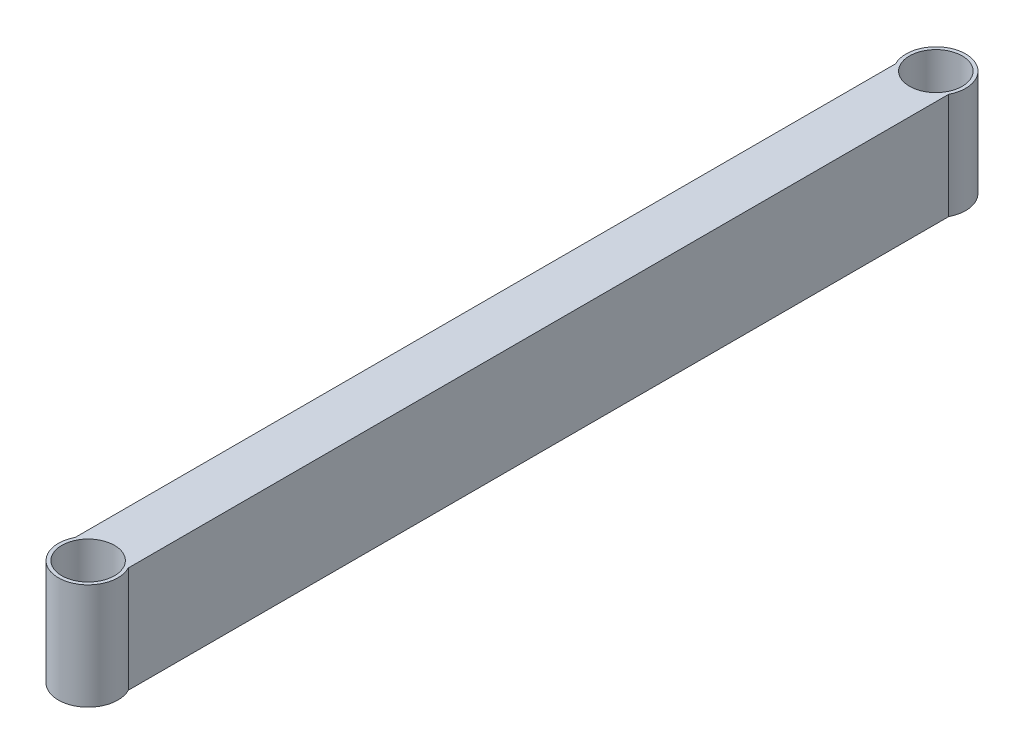
ISO-10303-21;
HEADER;
FILE_DESCRIPTION(('STEP AP214'),'2;1');
FILE_NAME('part.step','',(''),(''),'','','');
FILE_SCHEMA(('AUTOMOTIVE_DESIGN { 1 0 10303 214 1 1 1 1 }'));
ENDSEC;
DATA;
#1=APPLICATION_CONTEXT('core data for automotive mechanical design processes');
#2=APPLICATION_PROTOCOL_DEFINITION('international standard','automotive_design',2000,#1);
#3=PRODUCT_CONTEXT('',#1,'mechanical');
#4=PRODUCT('Part','Part','',(#3));
#5=PRODUCT_RELATED_PRODUCT_CATEGORY('part','',(#4));
#6=PRODUCT_DEFINITION_FORMATION('','',#4);
#7=PRODUCT_DEFINITION_CONTEXT('part definition',#1,'design');
#8=PRODUCT_DEFINITION('design','',#6,#7);
#9=PRODUCT_DEFINITION_SHAPE('','',#8);
#10=(LENGTH_UNIT() NAMED_UNIT(*) SI_UNIT(.MILLI.,.METRE.));
#11=(NAMED_UNIT(*) PLANE_ANGLE_UNIT() SI_UNIT($,.RADIAN.));
#12=(NAMED_UNIT(*) SI_UNIT($,.STERADIAN.) SOLID_ANGLE_UNIT());
#13=UNCERTAINTY_MEASURE_WITH_UNIT(LENGTH_MEASURE(1.E-05),#10,'distance_accuracy_value','');
#14=(GEOMETRIC_REPRESENTATION_CONTEXT(3) GLOBAL_UNCERTAINTY_ASSIGNED_CONTEXT((#13)) GLOBAL_UNIT_ASSIGNED_CONTEXT((#10,
#11,#12)) REPRESENTATION_CONTEXT('',''));
#15=CARTESIAN_POINT('',(0.,0.,0.));
#16=DIRECTION('',(0.,0.,1.));
#17=DIRECTION('',(1.,0.,0.));
#18=AXIS2_PLACEMENT_3D('',#15,#16,#17);
#19=CARTESIAN_POINT('',(0.,-25.4,406.4));
#20=DIRECTION('',(0.,1.,0.));
#21=DIRECTION('',(0.,0.,1.));
#22=AXIS2_PLACEMENT_3D('',#19,#20,#21);
#23=CYLINDRICAL_SURFACE('',#22,14.2875);
#24=DIRECTION('',(0.,1.,0.));
#25=VECTOR('',#24,1.);
#26=CARTESIAN_POINT('',(12.7,-25.4,399.854569819332));
#27=LINE('',#26,#25);
#28=CARTESIAN_POINT('',(12.7,25.4,399.854569819332));
#29=VERTEX_POINT('',#28);
#30=CARTESIAN_POINT('',(12.7,-25.4,399.854569819332));
#31=VERTEX_POINT('',#30);
#32=EDGE_CURVE('E134',#29,#31,#27,.F.);
#33=ORIENTED_EDGE('',*,*,#32,.F.);
#34=CARTESIAN_POINT('',(0.,25.4,406.4));
#35=DIRECTION('',(0.,1.,0.));
#36=DIRECTION('',(0.,0.,1.));
#37=AXIS2_PLACEMENT_3D('',#34,#35,#36);
#38=CIRCLE('',#37,14.2875);
#39=CARTESIAN_POINT('',(-12.7,25.4,399.854569819332));
#40=VERTEX_POINT('',#39);
#41=EDGE_CURVE('E122',#40,#29,#38,.T.);
#42=ORIENTED_EDGE('',*,*,#41,.F.);
#43=DIRECTION('',(0.,1.,0.));
#44=VECTOR('',#43,1.);
#45=CARTESIAN_POINT('',(-12.7,-25.4,399.854569819332));
#46=LINE('',#45,#44);
#47=CARTESIAN_POINT('',(-12.7,-25.4,399.854569819332));
#48=VERTEX_POINT('',#47);
#49=EDGE_CURVE('E129',#48,#40,#46,.T.);
#50=ORIENTED_EDGE('',*,*,#49,.F.);
#51=CARTESIAN_POINT('',(0.,-25.4,406.4));
#52=DIRECTION('',(0.,1.,0.));
#53=DIRECTION('',(0.,0.,1.));
#54=AXIS2_PLACEMENT_3D('',#51,#52,#53);
#55=CIRCLE('',#54,14.2875);
#56=EDGE_CURVE('E138',#48,#31,#55,.T.);
#57=ORIENTED_EDGE('',*,*,#56,.T.);
#58=EDGE_LOOP('',(#33,#42,#50,#57));
#59=FACE_BOUND('',#58,.T.);
#60=ADVANCED_FACE('F43',(#59),#23,.T.);
#61=CARTESIAN_POINT('',(0.,-25.4,406.4));
#62=DIRECTION('',(0.,1.,0.));
#63=DIRECTION('',(0.,0.,1.));
#64=AXIS2_PLACEMENT_3D('',#61,#62,#63);
#65=CYLINDRICAL_SURFACE('',#64,12.6365);
#66=CARTESIAN_POINT('',(0.,-25.4,406.4));
#67=DIRECTION('',(0.,1.,0.));
#68=DIRECTION('',(0.,0.,1.));
#69=AXIS2_PLACEMENT_3D('',#66,#67,#68);
#70=CIRCLE('',#69,12.6365);
#71=CARTESIAN_POINT('',(0.,-25.4,419.0365));
#72=VERTEX_POINT('',#71);
#73=EDGE_CURVE('E139',#72,#72,#70,.T.);
#74=ORIENTED_EDGE('',*,*,#73,.F.);
#75=EDGE_LOOP('',(#74));
#76=FACE_BOUND('',#75,.T.);
#77=CARTESIAN_POINT('',(0.,25.4,406.4));
#78=DIRECTION('',(0.,1.,0.));
#79=DIRECTION('',(0.,0.,1.));
#80=AXIS2_PLACEMENT_3D('',#77,#78,#79);
#81=CIRCLE('',#80,12.6365);
#82=CARTESIAN_POINT('',(0.,25.4,419.0365));
#83=VERTEX_POINT('',#82);
#84=EDGE_CURVE('E144',#83,#83,#81,.T.);
#85=ORIENTED_EDGE('',*,*,#84,.T.);
#86=EDGE_LOOP('',(#85));
#87=FACE_BOUND('',#86,.T.);
#88=ADVANCED_FACE('F254',(#76,#87),#65,.F.);
#89=CARTESIAN_POINT('',(0.,-25.4,0.));
#90=DIRECTION('',(0.,1.,0.));
#91=DIRECTION('',(0.,0.,1.));
#92=AXIS2_PLACEMENT_3D('',#89,#90,#91);
#93=CYLINDRICAL_SURFACE('',#92,12.6365);
#94=CARTESIAN_POINT('',(0.,-25.4,0.));
#95=DIRECTION('',(0.,1.,0.));
#96=DIRECTION('',(0.,0.,1.));
#97=AXIS2_PLACEMENT_3D('',#94,#95,#96);
#98=CIRCLE('',#97,12.6365);
#99=CARTESIAN_POINT('',(0.,-25.4,12.6365));
#100=VERTEX_POINT('',#99);
#101=EDGE_CURVE('E148',#100,#100,#98,.T.);
#102=ORIENTED_EDGE('',*,*,#101,.F.);
#103=EDGE_LOOP('',(#102));
#104=FACE_BOUND('',#103,.T.);
#105=CARTESIAN_POINT('',(0.,25.4,0.));
#106=DIRECTION('',(0.,1.,0.));
#107=DIRECTION('',(0.,0.,1.));
#108=AXIS2_PLACEMENT_3D('',#105,#106,#107);
#109=CIRCLE('',#108,12.6365);
#110=CARTESIAN_POINT('',(0.,25.4,12.6365));
#111=VERTEX_POINT('',#110);
#112=EDGE_CURVE('E141',#111,#111,#109,.T.);
#113=ORIENTED_EDGE('',*,*,#112,.T.);
#114=EDGE_LOOP('',(#113));
#115=FACE_BOUND('',#114,.T.);
#116=ADVANCED_FACE('F250',(#104,#115),#93,.F.);
#117=CARTESIAN_POINT('',(0.,-25.4,0.));
#118=DIRECTION('',(0.,1.,0.));
#119=DIRECTION('',(0.,0.,1.));
#120=AXIS2_PLACEMENT_3D('',#117,#118,#119);
#121=CYLINDRICAL_SURFACE('',#120,14.2875);
#122=DIRECTION('',(0.,1.,0.));
#123=VECTOR('',#122,1.);
#124=CARTESIAN_POINT('',(12.7,-25.4,6.54543018066805));
#125=LINE('',#124,#123);
#126=CARTESIAN_POINT('',(12.7,-25.4,6.54543018066805));
#127=VERTEX_POINT('',#126);
#128=CARTESIAN_POINT('',(12.7,25.4,6.54543018066805));
#129=VERTEX_POINT('',#128);
#130=EDGE_CURVE('E185',#127,#129,#125,.T.);
#131=ORIENTED_EDGE('',*,*,#130,.F.);
#132=CARTESIAN_POINT('',(0.,-25.4,0.));
#133=DIRECTION('',(0.,1.,0.));
#134=DIRECTION('',(0.,0.,1.));
#135=AXIS2_PLACEMENT_3D('',#132,#133,#134);
#136=CIRCLE('',#135,14.2875);
#137=CARTESIAN_POINT('',(-12.7,-25.4,6.54543018066802));
#138=VERTEX_POINT('',#137);
#139=EDGE_CURVE('E155',#127,#138,#136,.T.);
#140=ORIENTED_EDGE('',*,*,#139,.T.);
#141=DIRECTION('',(0.,1.,0.));
#142=VECTOR('',#141,1.);
#143=CARTESIAN_POINT('',(-12.7,-25.4,6.54543018066802));
#144=LINE('',#143,#142);
#145=CARTESIAN_POINT('',(-12.7,25.4,6.54543018066802));
#146=VERTEX_POINT('',#145);
#147=EDGE_CURVE('E182',#146,#138,#144,.F.);
#148=ORIENTED_EDGE('',*,*,#147,.F.);
#149=CARTESIAN_POINT('',(0.,25.4,0.));
#150=DIRECTION('',(0.,1.,0.));
#151=DIRECTION('',(0.,0.,1.));
#152=AXIS2_PLACEMENT_3D('',#149,#150,#151);
#153=CIRCLE('',#152,14.2875);
#154=EDGE_CURVE('E124',#129,#146,#153,.T.);
#155=ORIENTED_EDGE('',*,*,#154,.F.);
#156=EDGE_LOOP('',(#131,#140,#148,#155));
#157=FACE_BOUND('',#156,.T.);
#158=ADVANCED_FACE('F246',(#157),#121,.T.);
#159=CARTESIAN_POINT('',(-12.7,25.4,406.4));
#160=DIRECTION('',(0.,-1.,0.));
#161=DIRECTION('',(0.,0.,-1.));
#162=AXIS2_PLACEMENT_3D('',#159,#160,#161);
#163=PLANE('',#162);
#164=DIRECTION('',(0.,0.,-1.));
#165=VECTOR('',#164,1.);
#166=CARTESIAN_POINT('',(-12.7,25.4,406.4));
#167=LINE('',#166,#165);
#168=EDGE_CURVE('E117',#40,#146,#167,.T.);
#169=ORIENTED_EDGE('',*,*,#168,.F.);
#170=ORIENTED_EDGE('',*,*,#41,.T.);
#171=DIRECTION('',(0.,0.,-1.));
#172=VECTOR('',#171,1.);
#173=CARTESIAN_POINT('',(12.7,25.4,406.4));
#174=LINE('',#173,#172);
#175=EDGE_CURVE('E127',#29,#129,#174,.T.);
#176=ORIENTED_EDGE('',*,*,#175,.T.);
#177=ORIENTED_EDGE('',*,*,#154,.T.);
#178=EDGE_LOOP('',(#169,#170,#176,#177));
#179=FACE_BOUND('',#178,.T.);
#180=ORIENTED_EDGE('',*,*,#112,.F.);
#181=EDGE_LOOP('',(#180));
#182=FACE_BOUND('',#181,.T.);
#183=ORIENTED_EDGE('',*,*,#84,.F.);
#184=EDGE_LOOP('',(#183));
#185=FACE_BOUND('',#184,.T.);
#186=ADVANCED_FACE('F118',(#179,#182,#185),#163,.F.);
#187=CARTESIAN_POINT('',(-12.7,-25.4,406.4));
#188=DIRECTION('',(0.,1.,0.));
#189=DIRECTION('',(0.,0.,1.));
#190=AXIS2_PLACEMENT_3D('',#187,#188,#189);
#191=PLANE('',#190);
#192=DIRECTION('',(0.,0.,-1.));
#193=VECTOR('',#192,1.);
#194=CARTESIAN_POINT('',(12.7,-25.4,406.4));
#195=LINE('',#194,#193);
#196=EDGE_CURVE('E200',#31,#127,#195,.T.);
#197=ORIENTED_EDGE('',*,*,#196,.F.);
#198=ORIENTED_EDGE('',*,*,#56,.F.);
#199=DIRECTION('',(0.,0.,-1.));
#200=VECTOR('',#199,1.);
#201=CARTESIAN_POINT('',(-12.7,-25.4,406.4));
#202=LINE('',#201,#200);
#203=EDGE_CURVE('E59',#48,#138,#202,.T.);
#204=ORIENTED_EDGE('',*,*,#203,.T.);
#205=ORIENTED_EDGE('',*,*,#139,.F.);
#206=EDGE_LOOP('',(#197,#198,#204,#205));
#207=FACE_BOUND('',#206,.T.);
#208=ORIENTED_EDGE('',*,*,#101,.T.);
#209=EDGE_LOOP('',(#208));
#210=FACE_BOUND('',#209,.T.);
#211=ORIENTED_EDGE('',*,*,#73,.T.);
#212=EDGE_LOOP('',(#211));
#213=FACE_BOUND('',#212,.T.);
#214=ADVANCED_FACE('F240',(#207,#210,#213),#191,.F.);
#215=CARTESIAN_POINT('',(-12.7,-25.4,406.4));
#216=DIRECTION('',(1.,0.,0.));
#217=DIRECTION('',(0.,0.,-1.));
#218=AXIS2_PLACEMENT_3D('',#215,#216,#217);
#219=PLANE('',#218);
#220=ORIENTED_EDGE('',*,*,#203,.F.);
#221=ORIENTED_EDGE('',*,*,#49,.T.);
#222=ORIENTED_EDGE('',*,*,#168,.T.);
#223=ORIENTED_EDGE('',*,*,#147,.T.);
#224=EDGE_LOOP('',(#220,#221,#222,#223));
#225=FACE_BOUND('',#224,.T.);
#226=ADVANCED_FACE('F130',(#225),#219,.F.);
#227=CARTESIAN_POINT('',(12.7,-25.4,406.4));
#228=DIRECTION('',(-1.,0.,0.));
#229=DIRECTION('',(0.,0.,1.));
#230=AXIS2_PLACEMENT_3D('',#227,#228,#229);
#231=PLANE('',#230);
#232=ORIENTED_EDGE('',*,*,#175,.F.);
#233=ORIENTED_EDGE('',*,*,#32,.T.);
#234=ORIENTED_EDGE('',*,*,#196,.T.);
#235=ORIENTED_EDGE('',*,*,#130,.T.);
#236=EDGE_LOOP('',(#232,#233,#234,#235));
#237=FACE_BOUND('',#236,.T.);
#238=ADVANCED_FACE('F45',(#237),#231,.F.);
#239=CLOSED_SHELL('',(#60,#88,#116,#158,#186,#214,#226,#238));
#240=CARTESIAN_POINT('',(-11.1252,-23.8252,406.4));
#241=DIRECTION('',(0.,1.,0.));
#242=DIRECTION('',(0.,0.,1.));
#243=AXIS2_PLACEMENT_3D('',#240,#241,#242);
#244=PLANE('',#243);
#245=CARTESIAN_POINT('',(0.,-23.8252,406.4));
#246=DIRECTION('',(0.,1.,0.));
#247=DIRECTION('',(0.,0.,1.));
#248=AXIS2_PLACEMENT_3D('',#245,#246,#247);
#249=CIRCLE('',#248,14.2875);
#250=CARTESIAN_POINT('',(11.1252,-23.8252,397.435482098294));
#251=VERTEX_POINT('',#250);
#252=CARTESIAN_POINT('',(-11.1252,-23.8252,397.435482098294));
#253=VERTEX_POINT('',#252);
#254=EDGE_CURVE('E135',#251,#253,#249,.T.);
#255=ORIENTED_EDGE('',*,*,#254,.F.);
#256=DIRECTION('',(0.,0.,-1.));
#257=VECTOR('',#256,1.);
#258=CARTESIAN_POINT('',(11.1252,-23.8252,406.4));
#259=LINE('',#258,#257);
#260=CARTESIAN_POINT('',(11.1252,-23.8252,8.9645179017056));
#261=VERTEX_POINT('',#260);
#262=EDGE_CURVE('E197',#251,#261,#259,.T.);
#263=ORIENTED_EDGE('',*,*,#262,.T.);
#264=CARTESIAN_POINT('',(0.,-23.8252,0.));
#265=DIRECTION('',(0.,1.,0.));
#266=DIRECTION('',(0.,0.,1.));
#267=AXIS2_PLACEMENT_3D('',#264,#265,#266);
#268=CIRCLE('',#267,14.2875);
#269=CARTESIAN_POINT('',(-11.1252,-23.8252,8.96451790170559));
#270=VERTEX_POINT('',#269);
#271=EDGE_CURVE('E178',#270,#261,#268,.T.);
#272=ORIENTED_EDGE('',*,*,#271,.F.);
#273=DIRECTION('',(0.,0.,-1.));
#274=VECTOR('',#273,1.);
#275=CARTESIAN_POINT('',(-11.1252,-23.8252,406.4));
#276=LINE('',#275,#274);
#277=EDGE_CURVE('E188',#253,#270,#276,.T.);
#278=ORIENTED_EDGE('',*,*,#277,.F.);
#279=EDGE_LOOP('',(#255,#263,#272,#278));
#280=FACE_BOUND('',#279,.T.);
#281=ADVANCED_FACE('F215',(#280),#244,.T.);
#282=CARTESIAN_POINT('',(11.1252,-23.8252,406.4));
#283=DIRECTION('',(-1.,0.,0.));
#284=DIRECTION('',(0.,-1.,0.));
#285=AXIS2_PLACEMENT_3D('',#282,#283,#284);
#286=PLANE('',#285);
#287=DIRECTION('',(0.,1.,0.));
#288=VECTOR('',#287,1.);
#289=CARTESIAN_POINT('',(11.1252,-25.4,397.435482098294));
#290=LINE('',#289,#288);
#291=CARTESIAN_POINT('',(11.1252,23.8252,397.435482098294));
#292=VERTEX_POINT('',#291);
#293=EDGE_CURVE('E164',#292,#251,#290,.F.);
#294=ORIENTED_EDGE('',*,*,#293,.F.);
#295=DIRECTION('',(0.,0.,-1.));
#296=VECTOR('',#295,1.);
#297=CARTESIAN_POINT('',(11.1252,23.8252,406.4));
#298=LINE('',#297,#296);
#299=CARTESIAN_POINT('',(11.1252,23.8252,8.9645179017056));
#300=VERTEX_POINT('',#299);
#301=EDGE_CURVE('E194',#292,#300,#298,.T.);
#302=ORIENTED_EDGE('',*,*,#301,.T.);
#303=DIRECTION('',(0.,1.,0.));
#304=VECTOR('',#303,1.);
#305=CARTESIAN_POINT('',(11.1252,-25.4,8.9645179017056));
#306=LINE('',#305,#304);
#307=EDGE_CURVE('E174',#261,#300,#306,.T.);
#308=ORIENTED_EDGE('',*,*,#307,.F.);
#309=ORIENTED_EDGE('',*,*,#262,.F.);
#310=EDGE_LOOP('',(#294,#302,#308,#309));
#311=FACE_BOUND('',#310,.T.);
#312=ADVANCED_FACE('F221',(#311),#286,.T.);
#313=CARTESIAN_POINT('',(-11.1252,23.8252,406.4));
#314=DIRECTION('',(0.,-1.,0.));
#315=DIRECTION('',(0.,0.,-1.));
#316=AXIS2_PLACEMENT_3D('',#313,#314,#315);
#317=PLANE('',#316);
#318=CARTESIAN_POINT('',(0.,23.8252,406.4));
#319=DIRECTION('',(0.,-1.,0.));
#320=DIRECTION('',(0.,0.,-1.));
#321=AXIS2_PLACEMENT_3D('',#318,#319,#320);
#322=CIRCLE('',#321,14.2875);
#323=CARTESIAN_POINT('',(-11.1252,23.8252,397.435482098294));
#324=VERTEX_POINT('',#323);
#325=EDGE_CURVE('E159',#324,#292,#322,.T.);
#326=ORIENTED_EDGE('',*,*,#325,.F.);
#327=DIRECTION('',(0.,0.,-1.));
#328=VECTOR('',#327,1.);
#329=CARTESIAN_POINT('',(-11.1252,23.8252,406.4));
#330=LINE('',#329,#328);
#331=CARTESIAN_POINT('',(-11.1252,23.8252,8.96451790170561));
#332=VERTEX_POINT('',#331);
#333=EDGE_CURVE('E191',#324,#332,#330,.T.);
#334=ORIENTED_EDGE('',*,*,#333,.T.);
#335=CARTESIAN_POINT('',(0.,23.8252,0.));
#336=DIRECTION('',(0.,-1.,0.));
#337=DIRECTION('',(0.,0.,-1.));
#338=AXIS2_PLACEMENT_3D('',#335,#336,#337);
#339=CIRCLE('',#338,14.2875);
#340=EDGE_CURVE('E170',#300,#332,#339,.T.);
#341=ORIENTED_EDGE('',*,*,#340,.F.);
#342=ORIENTED_EDGE('',*,*,#301,.F.);
#343=EDGE_LOOP('',(#326,#334,#341,#342));
#344=FACE_BOUND('',#343,.T.);
#345=ADVANCED_FACE('F224',(#344),#317,.T.);
#346=CARTESIAN_POINT('',(-11.1252,-23.8252,406.4));
#347=DIRECTION('',(1.,0.,0.));
#348=DIRECTION('',(0.,0.,-1.));
#349=AXIS2_PLACEMENT_3D('',#346,#347,#348);
#350=PLANE('',#349);
#351=DIRECTION('',(0.,1.,0.));
#352=VECTOR('',#351,1.);
#353=CARTESIAN_POINT('',(-11.1252,-25.4,397.435482098294));
#354=LINE('',#353,#352);
#355=EDGE_CURVE('E11',#253,#324,#354,.T.);
#356=ORIENTED_EDGE('',*,*,#355,.F.);
#357=ORIENTED_EDGE('',*,*,#277,.T.);
#358=DIRECTION('',(0.,1.,0.));
#359=VECTOR('',#358,1.);
#360=CARTESIAN_POINT('',(-11.1252,-25.4,8.96451790170558));
#361=LINE('',#360,#359);
#362=EDGE_CURVE('E52',#332,#270,#361,.F.);
#363=ORIENTED_EDGE('',*,*,#362,.F.);
#364=ORIENTED_EDGE('',*,*,#333,.F.);
#365=EDGE_LOOP('',(#356,#357,#363,#364));
#366=FACE_BOUND('',#365,.T.);
#367=ADVANCED_FACE('F212',(#366),#350,.T.);
#368=ORIENTED_EDGE('',*,*,#362,.T.);
#369=ORIENTED_EDGE('',*,*,#271,.T.);
#370=ORIENTED_EDGE('',*,*,#307,.T.);
#371=ORIENTED_EDGE('',*,*,#340,.T.);
#372=EDGE_LOOP('',(#368,#369,#370,#371));
#373=FACE_BOUND('',#372,.T.);
#374=ADVANCED_FACE('F210',(#373),#121,.T.);
#375=ORIENTED_EDGE('',*,*,#293,.T.);
#376=ORIENTED_EDGE('',*,*,#254,.T.);
#377=ORIENTED_EDGE('',*,*,#355,.T.);
#378=ORIENTED_EDGE('',*,*,#325,.T.);
#379=EDGE_LOOP('',(#375,#376,#377,#378));
#380=FACE_BOUND('',#379,.T.);
#381=ADVANCED_FACE('F218',(#380),#23,.T.);
#382=CLOSED_SHELL('',(#281,#312,#345,#367,#374,#381));
#383=ORIENTED_CLOSED_SHELL('',*,#382,.T.);
#384=BREP_WITH_VOIDS('B2',#239,(#383));
#385=ADVANCED_BREP_SHAPE_REPRESENTATION('',(#18,#384),#14);
#386=SHAPE_DEFINITION_REPRESENTATION(#9,#385);
ENDSEC;
END-ISO-10303-21;
